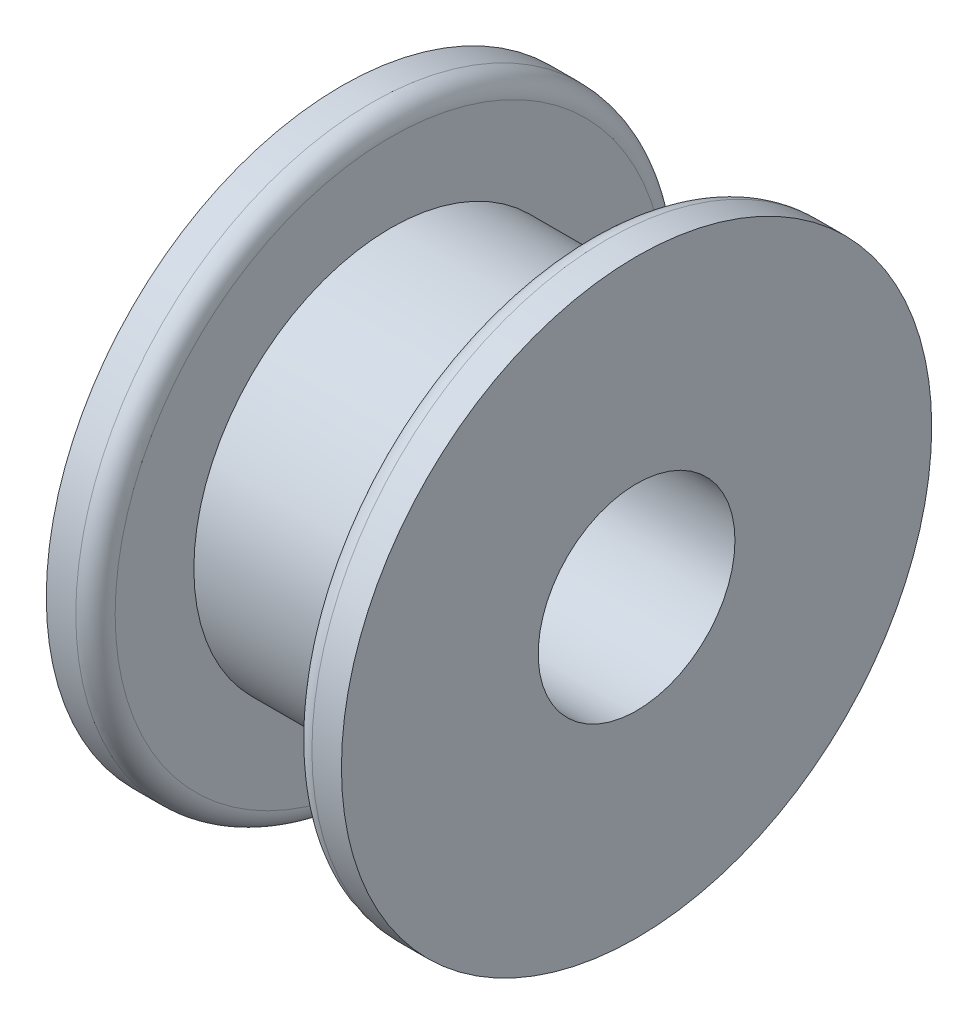
ISO-10303-21;
HEADER;
FILE_DESCRIPTION(('STEP AP214'),'2;1');
FILE_NAME('part.step','',(''),(''),'','','');
FILE_SCHEMA(('AUTOMOTIVE_DESIGN { 1 0 10303 214 1 1 1 1 }'));
ENDSEC;
DATA;
#1=APPLICATION_CONTEXT('core data for automotive mechanical design processes');
#2=APPLICATION_PROTOCOL_DEFINITION('international standard','automotive_design',2000,#1);
#3=PRODUCT_CONTEXT('',#1,'mechanical');
#4=PRODUCT('Part','Part','',(#3));
#5=PRODUCT_RELATED_PRODUCT_CATEGORY('part','',(#4));
#6=PRODUCT_DEFINITION_FORMATION('','',#4);
#7=PRODUCT_DEFINITION_CONTEXT('part definition',#1,'design');
#8=PRODUCT_DEFINITION('design','',#6,#7);
#9=PRODUCT_DEFINITION_SHAPE('','',#8);
#10=(LENGTH_UNIT() NAMED_UNIT(*) SI_UNIT(.MILLI.,.METRE.));
#11=(NAMED_UNIT(*) PLANE_ANGLE_UNIT() SI_UNIT($,.RADIAN.));
#12=(NAMED_UNIT(*) SI_UNIT($,.STERADIAN.) SOLID_ANGLE_UNIT());
#13=UNCERTAINTY_MEASURE_WITH_UNIT(LENGTH_MEASURE(1.E-05),#10,'distance_accuracy_value','');
#14=(GEOMETRIC_REPRESENTATION_CONTEXT(3) GLOBAL_UNCERTAINTY_ASSIGNED_CONTEXT((#13)) GLOBAL_UNIT_ASSIGNED_CONTEXT((#10,
#11,#12)) REPRESENTATION_CONTEXT('',''));
#15=CARTESIAN_POINT('',(0.,0.,0.));
#16=DIRECTION('',(0.,0.,1.));
#17=DIRECTION('',(1.,0.,0.));
#18=AXIS2_PLACEMENT_3D('',#15,#16,#17);
#19=CARTESIAN_POINT('',(6.35,0.,0.));
#20=DIRECTION('',(-1.,0.,0.));
#21=DIRECTION('',(0.,0.,1.));
#22=AXIS2_PLACEMENT_3D('',#19,#20,#21);
#23=CYLINDRICAL_SURFACE('',#22,12.7);
#24=CARTESIAN_POINT('',(6.35,0.,0.));
#25=DIRECTION('',(1.,0.,0.));
#26=DIRECTION('',(0.,0.,-1.));
#27=AXIS2_PLACEMENT_3D('',#24,#25,#26);
#28=CIRCLE('',#27,12.7);
#29=CARTESIAN_POINT('',(6.35,0.,-12.7));
#30=VERTEX_POINT('',#29);
#31=EDGE_CURVE('E60',#30,#30,#28,.T.);
#32=ORIENTED_EDGE('',*,*,#31,.F.);
#33=EDGE_LOOP('',(#32));
#34=FACE_BOUND('',#33,.T.);
#35=CARTESIAN_POINT('',(-6.35,0.,0.));
#36=DIRECTION('',(-1.,0.,0.));
#37=DIRECTION('',(0.,0.,1.));
#38=AXIS2_PLACEMENT_3D('',#35,#36,#37);
#39=CIRCLE('',#38,12.7);
#40=CARTESIAN_POINT('',(-6.35,0.,12.7));
#41=VERTEX_POINT('',#40);
#42=EDGE_CURVE('E68',#41,#41,#39,.T.);
#43=ORIENTED_EDGE('',*,*,#42,.F.);
#44=EDGE_LOOP('',(#43));
#45=FACE_BOUND('',#44,.T.);
#46=ADVANCED_FACE('F34',(#34,#45),#23,.T.);
#47=CARTESIAN_POINT('',(9.525,0.,0.));
#48=DIRECTION('',(-1.,0.,0.));
#49=DIRECTION('',(0.,0.,1.));
#50=AXIS2_PLACEMENT_3D('',#47,#48,#49);
#51=CYLINDRICAL_SURFACE('',#50,19.05);
#52=CARTESIAN_POINT('',(7.62,0.,0.));
#53=DIRECTION('',(1.,0.,0.));
#54=DIRECTION('',(0.,0.,-1.));
#55=AXIS2_PLACEMENT_3D('',#52,#53,#54);
#56=CIRCLE('',#55,19.05);
#57=CARTESIAN_POINT('',(7.62,0.,-19.05));
#58=VERTEX_POINT('',#57);
#59=EDGE_CURVE('E54',#58,#58,#56,.T.);
#60=ORIENTED_EDGE('',*,*,#59,.T.);
#61=EDGE_LOOP('',(#60));
#62=FACE_BOUND('',#61,.T.);
#63=CARTESIAN_POINT('',(9.525,0.,0.));
#64=DIRECTION('',(1.,0.,0.));
#65=DIRECTION('',(0.,0.,-1.));
#66=AXIS2_PLACEMENT_3D('',#63,#64,#65);
#67=CIRCLE('',#66,19.05);
#68=CARTESIAN_POINT('',(9.525,0.,-19.05));
#69=VERTEX_POINT('',#68);
#70=EDGE_CURVE('E64',#69,#69,#67,.T.);
#71=ORIENTED_EDGE('',*,*,#70,.F.);
#72=EDGE_LOOP('',(#71));
#73=FACE_BOUND('',#72,.T.);
#74=ADVANCED_FACE('F89',(#62,#73),#51,.T.);
#75=CARTESIAN_POINT('',(9.525,0.,0.));
#76=DIRECTION('',(1.,0.,0.));
#77=DIRECTION('',(0.,0.,-1.));
#78=AXIS2_PLACEMENT_3D('',#75,#76,#77);
#79=PLANE('',#78);
#80=CARTESIAN_POINT('',(9.525,0.,0.));
#81=DIRECTION('',(1.,0.,0.));
#82=DIRECTION('',(0.,0.,-1.));
#83=AXIS2_PLACEMENT_3D('',#80,#81,#82);
#84=CIRCLE('',#83,6.35);
#85=CARTESIAN_POINT('',(9.525,0.,-6.35));
#86=VERTEX_POINT('',#85);
#87=EDGE_CURVE('E74',#86,#86,#84,.T.);
#88=ORIENTED_EDGE('',*,*,#87,.F.);
#89=EDGE_LOOP('',(#88));
#90=FACE_BOUND('',#89,.T.);
#91=ORIENTED_EDGE('',*,*,#70,.T.);
#92=EDGE_LOOP('',(#91));
#93=FACE_BOUND('',#92,.T.);
#94=ADVANCED_FACE('F85',(#90,#93),#79,.T.);
#95=CARTESIAN_POINT('',(6.35,0.,0.));
#96=DIRECTION('',(1.,0.,0.));
#97=DIRECTION('',(0.,0.,-1.));
#98=AXIS2_PLACEMENT_3D('',#95,#96,#97);
#99=PLANE('',#98);
#100=CARTESIAN_POINT('',(6.35,0.,0.));
#101=DIRECTION('',(1.,0.,0.));
#102=DIRECTION('',(0.,0.,-1.));
#103=AXIS2_PLACEMENT_3D('',#100,#101,#102);
#104=CIRCLE('',#103,17.78);
#105=CARTESIAN_POINT('',(6.35,0.,-17.78));
#106=VERTEX_POINT('',#105);
#107=EDGE_CURVE('E48',#106,#106,#104,.F.);
#108=ORIENTED_EDGE('',*,*,#107,.T.);
#109=EDGE_LOOP('',(#108));
#110=FACE_BOUND('',#109,.T.);
#111=ORIENTED_EDGE('',*,*,#31,.T.);
#112=EDGE_LOOP('',(#111));
#113=FACE_BOUND('',#112,.T.);
#114=ADVANCED_FACE('F88',(#110,#113),#99,.F.);
#115=CARTESIAN_POINT('',(7.62,0.,0.));
#116=DIRECTION('',(1.,0.,0.));
#117=DIRECTION('',(0.,0.,-1.));
#118=AXIS2_PLACEMENT_3D('',#115,#116,#117);
#119=TOROIDAL_SURFACE('',#118,17.78,1.27);
#120=ORIENTED_EDGE('',*,*,#107,.F.);
#121=EDGE_LOOP('',(#120));
#122=FACE_BOUND('',#121,.T.);
#123=ORIENTED_EDGE('',*,*,#59,.F.);
#124=EDGE_LOOP('',(#123));
#125=FACE_BOUND('',#124,.T.);
#126=ADVANCED_FACE('F102',(#122,#125),#119,.T.);
#127=CARTESIAN_POINT('',(-9.525,0.,0.));
#128=DIRECTION('',(1.,0.,0.));
#129=DIRECTION('',(0.,0.,-1.));
#130=AXIS2_PLACEMENT_3D('',#127,#128,#129);
#131=CYLINDRICAL_SURFACE('',#130,19.05);
#132=CARTESIAN_POINT('',(-7.62,0.,0.));
#133=DIRECTION('',(-1.,0.,0.));
#134=DIRECTION('',(0.,0.,1.));
#135=AXIS2_PLACEMENT_3D('',#132,#133,#134);
#136=CIRCLE('',#135,19.05);
#137=CARTESIAN_POINT('',(-7.62,0.,19.05));
#138=VERTEX_POINT('',#137);
#139=EDGE_CURVE('E10',#138,#138,#136,.T.);
#140=ORIENTED_EDGE('',*,*,#139,.T.);
#141=EDGE_LOOP('',(#140));
#142=FACE_BOUND('',#141,.T.);
#143=CARTESIAN_POINT('',(-9.525,0.,0.));
#144=DIRECTION('',(1.,0.,0.));
#145=DIRECTION('',(0.,0.,-1.));
#146=AXIS2_PLACEMENT_3D('',#143,#144,#145);
#147=CIRCLE('',#146,19.05);
#148=CARTESIAN_POINT('',(-9.525,0.,-19.05));
#149=VERTEX_POINT('',#148);
#150=EDGE_CURVE('E71',#149,#149,#147,.T.);
#151=ORIENTED_EDGE('',*,*,#150,.T.);
#152=EDGE_LOOP('',(#151));
#153=FACE_BOUND('',#152,.T.);
#154=ADVANCED_FACE('F104',(#142,#153),#131,.T.);
#155=CARTESIAN_POINT('',(-9.525,0.,0.));
#156=DIRECTION('',(-1.,0.,0.));
#157=DIRECTION('',(0.,0.,-1.));
#158=AXIS2_PLACEMENT_3D('',#155,#156,#157);
#159=PLANE('',#158);
#160=CARTESIAN_POINT('',(-9.525,0.,0.));
#161=DIRECTION('',(-1.,0.,0.));
#162=DIRECTION('',(0.,0.,1.));
#163=AXIS2_PLACEMENT_3D('',#160,#161,#162);
#164=CIRCLE('',#163,6.35);
#165=CARTESIAN_POINT('',(-9.525,0.,6.35));
#166=VERTEX_POINT('',#165);
#167=EDGE_CURVE('E75',#166,#166,#164,.F.);
#168=ORIENTED_EDGE('',*,*,#167,.T.);
#169=EDGE_LOOP('',(#168));
#170=FACE_BOUND('',#169,.T.);
#171=ORIENTED_EDGE('',*,*,#150,.F.);
#172=EDGE_LOOP('',(#171));
#173=FACE_BOUND('',#172,.T.);
#174=ADVANCED_FACE('F110',(#170,#173),#159,.T.);
#175=CARTESIAN_POINT('',(-6.35,0.,0.));
#176=DIRECTION('',(-1.,0.,0.));
#177=DIRECTION('',(0.,0.,-1.));
#178=AXIS2_PLACEMENT_3D('',#175,#176,#177);
#179=PLANE('',#178);
#180=CARTESIAN_POINT('',(-6.35,0.,0.));
#181=DIRECTION('',(-1.,0.,0.));
#182=DIRECTION('',(0.,0.,1.));
#183=AXIS2_PLACEMENT_3D('',#180,#181,#182);
#184=CIRCLE('',#183,17.78);
#185=CARTESIAN_POINT('',(-6.35,0.,17.78));
#186=VERTEX_POINT('',#185);
#187=EDGE_CURVE('E42',#186,#186,#184,.F.);
#188=ORIENTED_EDGE('',*,*,#187,.T.);
#189=EDGE_LOOP('',(#188));
#190=FACE_BOUND('',#189,.T.);
#191=ORIENTED_EDGE('',*,*,#42,.T.);
#192=EDGE_LOOP('',(#191));
#193=FACE_BOUND('',#192,.T.);
#194=ADVANCED_FACE('F121',(#190,#193),#179,.F.);
#195=CARTESIAN_POINT('',(-7.62,0.,0.));
#196=DIRECTION('',(-1.,0.,0.));
#197=DIRECTION('',(0.,0.,1.));
#198=AXIS2_PLACEMENT_3D('',#195,#196,#197);
#199=TOROIDAL_SURFACE('',#198,17.78,1.27);
#200=ORIENTED_EDGE('',*,*,#139,.F.);
#201=EDGE_LOOP('',(#200));
#202=FACE_BOUND('',#201,.T.);
#203=ORIENTED_EDGE('',*,*,#187,.F.);
#204=EDGE_LOOP('',(#203));
#205=FACE_BOUND('',#204,.T.);
#206=ADVANCED_FACE('F36',(#202,#205),#199,.T.);
#207=CARTESIAN_POINT('',(-9.526,0.,0.));
#208=DIRECTION('',(1.,0.,0.));
#209=DIRECTION('',(0.,0.,-1.));
#210=AXIS2_PLACEMENT_3D('',#207,#208,#209);
#211=CYLINDRICAL_SURFACE('',#210,6.35);
#212=ORIENTED_EDGE('',*,*,#167,.F.);
#213=EDGE_LOOP('',(#212));
#214=FACE_BOUND('',#213,.T.);
#215=ORIENTED_EDGE('',*,*,#87,.T.);
#216=EDGE_LOOP('',(#215));
#217=FACE_BOUND('',#216,.T.);
#218=ADVANCED_FACE('F83',(#214,#217),#211,.F.);
#219=CLOSED_SHELL('',(#46,#74,#94,#114,#126,#154,#174,#194,#206,#218));
#220=MANIFOLD_SOLID_BREP('B2',#219);
#221=ADVANCED_BREP_SHAPE_REPRESENTATION('',(#18,#220),#14);
#222=SHAPE_DEFINITION_REPRESENTATION(#9,#221);
ENDSEC;
END-ISO-10303-21;
